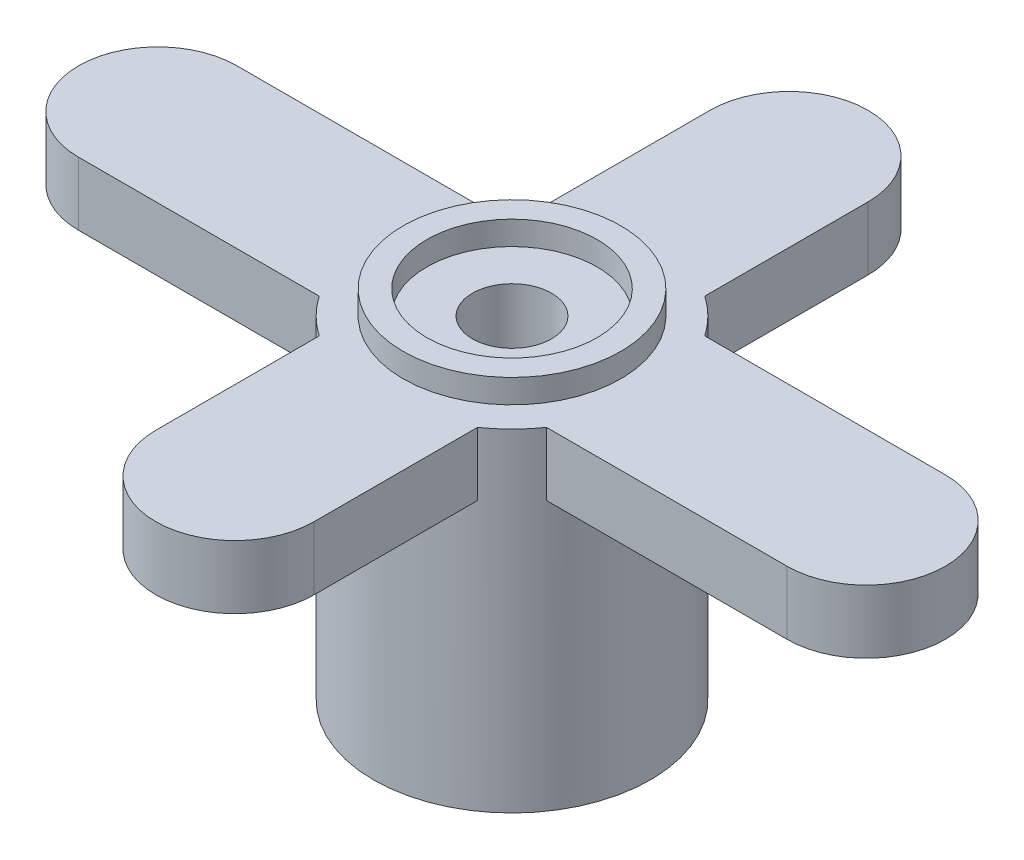
ISO-10303-21;
HEADER;
FILE_DESCRIPTION(('STEP AP214'),'2;1');
FILE_NAME('part.step','',(''),(''),'','','');
FILE_SCHEMA(('AUTOMOTIVE_DESIGN { 1 0 10303 214 1 1 1 1 }'));
ENDSEC;
DATA;
#1=APPLICATION_CONTEXT('core data for automotive mechanical design processes');
#2=APPLICATION_PROTOCOL_DEFINITION('international standard','automotive_design',2000,#1);
#3=PRODUCT_CONTEXT('',#1,'mechanical');
#4=PRODUCT('Part','Part','',(#3));
#5=PRODUCT_RELATED_PRODUCT_CATEGORY('part','',(#4));
#6=PRODUCT_DEFINITION_FORMATION('','',#4);
#7=PRODUCT_DEFINITION_CONTEXT('part definition',#1,'design');
#8=PRODUCT_DEFINITION('design','',#6,#7);
#9=PRODUCT_DEFINITION_SHAPE('','',#8);
#10=(LENGTH_UNIT() NAMED_UNIT(*) SI_UNIT(.MILLI.,.METRE.));
#11=(NAMED_UNIT(*) PLANE_ANGLE_UNIT() SI_UNIT($,.RADIAN.));
#12=(NAMED_UNIT(*) SI_UNIT($,.STERADIAN.) SOLID_ANGLE_UNIT());
#13=UNCERTAINTY_MEASURE_WITH_UNIT(LENGTH_MEASURE(1.E-05),#10,'distance_accuracy_value','');
#14=(GEOMETRIC_REPRESENTATION_CONTEXT(3) GLOBAL_UNCERTAINTY_ASSIGNED_CONTEXT((#13)) GLOBAL_UNIT_ASSIGNED_CONTEXT((#10,
#11,#12)) REPRESENTATION_CONTEXT('',''));
#15=CARTESIAN_POINT('',(0.,0.,0.));
#16=DIRECTION('',(0.,0.,1.));
#17=DIRECTION('',(1.,0.,0.));
#18=AXIS2_PLACEMENT_3D('',#15,#16,#17);
#19=CARTESIAN_POINT('',(0.,9.,0.));
#20=DIRECTION('',(0.,-1.,0.));
#21=DIRECTION('',(0.,0.,-1.));
#22=AXIS2_PLACEMENT_3D('',#19,#20,#21);
#23=CYLINDRICAL_SURFACE('',#22,3.5);
#24=CARTESIAN_POINT('',(0.,0.,0.));
#25=DIRECTION('',(0.,1.,0.));
#26=DIRECTION('',(0.,0.,1.));
#27=AXIS2_PLACEMENT_3D('',#24,#25,#26);
#28=CIRCLE('',#27,3.5);
#29=CARTESIAN_POINT('',(0.,0.,3.5));
#30=VERTEX_POINT('',#29);
#31=EDGE_CURVE('E178',#30,#30,#28,.T.);
#32=ORIENTED_EDGE('',*,*,#31,.T.);
#33=EDGE_LOOP('',(#32));
#34=FACE_BOUND('',#33,.T.);
#35=CARTESIAN_POINT('',(0.,8.4,0.));
#36=DIRECTION('',(0.,1.,0.));
#37=DIRECTION('',(0.,0.,1.));
#38=AXIS2_PLACEMENT_3D('',#35,#36,#37);
#39=CIRCLE('',#38,3.5);
#40=CARTESIAN_POINT('',(2.87228132326901,8.4,2.));
#41=VERTEX_POINT('',#40);
#42=CARTESIAN_POINT('',(2.,8.4,2.87228132326901));
#43=VERTEX_POINT('',#42);
#44=EDGE_CURVE('E164',#41,#43,#39,.F.);
#45=ORIENTED_EDGE('',*,*,#44,.T.);
#46=DIRECTION('',(0.,-1.,0.));
#47=VECTOR('',#46,1.);
#48=CARTESIAN_POINT('',(2.,9.,2.87228132326901));
#49=LINE('',#48,#47);
#50=CARTESIAN_POINT('',(2.,6.8,2.87228132326901));
#51=VERTEX_POINT('',#50);
#52=EDGE_CURVE('E203',#43,#51,#49,.T.);
#53=ORIENTED_EDGE('',*,*,#52,.T.);
#54=CARTESIAN_POINT('',(0.,6.8,0.));
#55=DIRECTION('',(0.,1.,0.));
#56=DIRECTION('',(0.,0.,1.));
#57=AXIS2_PLACEMENT_3D('',#54,#55,#56);
#58=CIRCLE('',#57,3.5);
#59=CARTESIAN_POINT('',(-2.,6.8,2.87228132326901));
#60=VERTEX_POINT('',#59);
#61=EDGE_CURVE('E11',#60,#51,#58,.T.);
#62=ORIENTED_EDGE('',*,*,#61,.F.);
#63=DIRECTION('',(0.,-1.,0.));
#64=VECTOR('',#63,1.);
#65=CARTESIAN_POINT('',(-2.,9.,2.87228132326901));
#66=LINE('',#65,#64);
#67=CARTESIAN_POINT('',(-2.,8.4,2.87228132326901));
#68=VERTEX_POINT('',#67);
#69=EDGE_CURVE('E46',#68,#60,#66,.T.);
#70=ORIENTED_EDGE('',*,*,#69,.F.);
#71=CARTESIAN_POINT('',(-2.87228132326901,8.4,2.));
#72=VERTEX_POINT('',#71);
#73=EDGE_CURVE('E153',#68,#72,#39,.F.);
#74=ORIENTED_EDGE('',*,*,#73,.T.);
#75=DIRECTION('',(0.,-1.,0.));
#76=VECTOR('',#75,1.);
#77=CARTESIAN_POINT('',(-2.87228132326901,9.,2.));
#78=LINE('',#77,#76);
#79=CARTESIAN_POINT('',(-2.87228132326901,6.8,2.));
#80=VERTEX_POINT('',#79);
#81=EDGE_CURVE('E156',#72,#80,#78,.T.);
#82=ORIENTED_EDGE('',*,*,#81,.T.);
#83=CARTESIAN_POINT('',(0.,6.8,0.));
#84=DIRECTION('',(0.,1.,0.));
#85=DIRECTION('',(0.,0.,1.));
#86=AXIS2_PLACEMENT_3D('',#83,#84,#85);
#87=CIRCLE('',#86,3.5);
#88=CARTESIAN_POINT('',(-2.87228132326901,6.8,-2.));
#89=VERTEX_POINT('',#88);
#90=EDGE_CURVE('E53',#89,#80,#87,.T.);
#91=ORIENTED_EDGE('',*,*,#90,.F.);
#92=DIRECTION('',(0.,-1.,0.));
#93=VECTOR('',#92,1.);
#94=CARTESIAN_POINT('',(-2.87228132326901,9.,-2.));
#95=LINE('',#94,#93);
#96=CARTESIAN_POINT('',(-2.87228132326901,8.4,-2.));
#97=VERTEX_POINT('',#96);
#98=EDGE_CURVE('E61',#97,#89,#95,.T.);
#99=ORIENTED_EDGE('',*,*,#98,.F.);
#100=CARTESIAN_POINT('',(-2.,8.4,-2.87228132326901));
#101=VERTEX_POINT('',#100);
#102=EDGE_CURVE('E162',#97,#101,#39,.F.);
#103=ORIENTED_EDGE('',*,*,#102,.T.);
#104=DIRECTION('',(0.,-1.,0.));
#105=VECTOR('',#104,1.);
#106=CARTESIAN_POINT('',(-2.,9.,-2.87228132326901));
#107=LINE('',#106,#105);
#108=CARTESIAN_POINT('',(-2.,6.8,-2.87228132326901));
#109=VERTEX_POINT('',#108);
#110=EDGE_CURVE('E187',#109,#101,#107,.F.);
#111=ORIENTED_EDGE('',*,*,#110,.F.);
#112=CARTESIAN_POINT('',(0.,6.8,0.));
#113=DIRECTION('',(0.,1.,0.));
#114=DIRECTION('',(0.,0.,1.));
#115=AXIS2_PLACEMENT_3D('',#112,#113,#114);
#116=CIRCLE('',#115,3.5);
#117=CARTESIAN_POINT('',(2.,6.8,-2.87228132326901));
#118=VERTEX_POINT('',#117);
#119=EDGE_CURVE('E193',#118,#109,#116,.T.);
#120=ORIENTED_EDGE('',*,*,#119,.F.);
#121=DIRECTION('',(0.,-1.,0.));
#122=VECTOR('',#121,1.);
#123=CARTESIAN_POINT('',(2.,9.,-2.87228132326901));
#124=LINE('',#123,#122);
#125=CARTESIAN_POINT('',(2.,8.4,-2.87228132326901));
#126=VERTEX_POINT('',#125);
#127=EDGE_CURVE('E190',#118,#126,#124,.F.);
#128=ORIENTED_EDGE('',*,*,#127,.T.);
#129=CARTESIAN_POINT('',(2.87228132326901,8.4,-2.));
#130=VERTEX_POINT('',#129);
#131=EDGE_CURVE('E402',#126,#130,#39,.F.);
#132=ORIENTED_EDGE('',*,*,#131,.T.);
#133=DIRECTION('',(0.,-1.,0.));
#134=VECTOR('',#133,1.);
#135=CARTESIAN_POINT('',(2.87228132326901,9.,-2.));
#136=LINE('',#135,#134);
#137=CARTESIAN_POINT('',(2.87228132326901,6.8,-2.));
#138=VERTEX_POINT('',#137);
#139=EDGE_CURVE('E195',#138,#130,#136,.F.);
#140=ORIENTED_EDGE('',*,*,#139,.F.);
#141=CARTESIAN_POINT('',(0.,6.8,0.));
#142=DIRECTION('',(0.,1.,0.));
#143=DIRECTION('',(0.,0.,1.));
#144=AXIS2_PLACEMENT_3D('',#141,#142,#143);
#145=CIRCLE('',#144,3.5);
#146=CARTESIAN_POINT('',(2.87228132326901,6.8,2.));
#147=VERTEX_POINT('',#146);
#148=EDGE_CURVE('E201',#147,#138,#145,.T.);
#149=ORIENTED_EDGE('',*,*,#148,.F.);
#150=DIRECTION('',(0.,-1.,0.));
#151=VECTOR('',#150,1.);
#152=CARTESIAN_POINT('',(2.87228132326901,9.,2.));
#153=LINE('',#152,#151);
#154=EDGE_CURVE('E198',#147,#41,#153,.F.);
#155=ORIENTED_EDGE('',*,*,#154,.T.);
#156=EDGE_LOOP('',(#45,#53,#62,#70,#74,#82,#91,#99,#103,#111,#120,#128,#132,#140,#149,#155));
#157=FACE_BOUND('',#156,.T.);
#158=ADVANCED_FACE('F39',(#34,#157),#23,.T.);
#159=CARTESIAN_POINT('',(0.,9.,0.));
#160=DIRECTION('',(0.,1.,0.));
#161=DIRECTION('',(0.,0.,1.));
#162=AXIS2_PLACEMENT_3D('',#159,#160,#161);
#163=PLANE('',#162);
#164=CARTESIAN_POINT('',(0.,9.,0.));
#165=DIRECTION('',(0.,1.,0.));
#166=DIRECTION('',(0.,0.,1.));
#167=AXIS2_PLACEMENT_3D('',#164,#165,#166);
#168=CIRCLE('',#167,2.15);
#169=CARTESIAN_POINT('',(0.,9.,2.15));
#170=VERTEX_POINT('',#169);
#171=EDGE_CURVE('E411',#170,#170,#168,.T.);
#172=ORIENTED_EDGE('',*,*,#171,.F.);
#173=EDGE_LOOP('',(#172));
#174=FACE_BOUND('',#173,.T.);
#175=CARTESIAN_POINT('',(0.,9.,0.));
#176=DIRECTION('',(0.,1.,0.));
#177=DIRECTION('',(0.,0.,1.));
#178=AXIS2_PLACEMENT_3D('',#175,#176,#177);
#179=CIRCLE('',#178,2.75);
#180=CARTESIAN_POINT('',(0.,9.,2.75));
#181=VERTEX_POINT('',#180);
#182=EDGE_CURVE('E400',#181,#181,#179,.T.);
#183=ORIENTED_EDGE('',*,*,#182,.T.);
#184=EDGE_LOOP('',(#183));
#185=FACE_BOUND('',#184,.T.);
#186=ADVANCED_FACE('F301',(#174,#185),#163,.T.);
#187=CARTESIAN_POINT('',(0.,0.,0.));
#188=DIRECTION('',(0.,1.,0.));
#189=DIRECTION('',(0.,0.,1.));
#190=AXIS2_PLACEMENT_3D('',#187,#188,#189);
#191=PLANE('',#190);
#192=CARTESIAN_POINT('',(0.,0.,0.));
#193=DIRECTION('',(0.,-1.,0.));
#194=DIRECTION('',(0.,0.,-1.));
#195=AXIS2_PLACEMENT_3D('',#192,#193,#194);
#196=CIRCLE('',#195,1.9);
#197=CARTESIAN_POINT('',(0.,0.,-1.9));
#198=VERTEX_POINT('',#197);
#199=EDGE_CURVE('E290',#198,#198,#196,.T.);
#200=ORIENTED_EDGE('',*,*,#199,.F.);
#201=EDGE_LOOP('',(#200));
#202=FACE_BOUND('',#201,.T.);
#203=ORIENTED_EDGE('',*,*,#31,.F.);
#204=EDGE_LOOP('',(#203));
#205=FACE_BOUND('',#204,.T.);
#206=ADVANCED_FACE('F298',(#202,#205),#191,.F.);
#207=CARTESIAN_POINT('',(0.,3.5,0.));
#208=DIRECTION('',(0.,-1.,0.));
#209=DIRECTION('',(0.,0.,-1.));
#210=AXIS2_PLACEMENT_3D('',#207,#208,#209);
#211=CYLINDRICAL_SURFACE('',#210,1.9);
#212=CARTESIAN_POINT('',(0.,3.5,0.));
#213=DIRECTION('',(0.,-1.,0.));
#214=DIRECTION('',(0.,0.,-1.));
#215=AXIS2_PLACEMENT_3D('',#212,#213,#214);
#216=CIRCLE('',#215,1.9);
#217=CARTESIAN_POINT('',(0.,3.5,-1.9));
#218=VERTEX_POINT('',#217);
#219=EDGE_CURVE('E182',#218,#218,#216,.T.);
#220=ORIENTED_EDGE('',*,*,#219,.F.);
#221=EDGE_LOOP('',(#220));
#222=FACE_BOUND('',#221,.T.);
#223=ORIENTED_EDGE('',*,*,#199,.T.);
#224=EDGE_LOOP('',(#223));
#225=FACE_BOUND('',#224,.T.);
#226=ADVANCED_FACE('F296',(#222,#225),#211,.F.);
#227=CARTESIAN_POINT('',(0.,3.5,0.));
#228=DIRECTION('',(0.,-1.,0.));
#229=DIRECTION('',(0.,0.,-1.));
#230=AXIS2_PLACEMENT_3D('',#227,#228,#229);
#231=PLANE('',#230);
#232=CARTESIAN_POINT('',(0.,3.5,0.));
#233=DIRECTION('',(0.,-1.,0.));
#234=DIRECTION('',(0.,0.,-1.));
#235=AXIS2_PLACEMENT_3D('',#232,#233,#234);
#236=CIRCLE('',#235,1.);
#237=CARTESIAN_POINT('',(0.,3.5,-1.));
#238=VERTEX_POINT('',#237);
#239=EDGE_CURVE('E408',#238,#238,#236,.T.);
#240=ORIENTED_EDGE('',*,*,#239,.F.);
#241=EDGE_LOOP('',(#240));
#242=FACE_BOUND('',#241,.T.);
#243=ORIENTED_EDGE('',*,*,#219,.T.);
#244=EDGE_LOOP('',(#243));
#245=FACE_BOUND('',#244,.T.);
#246=ADVANCED_FACE('F317',(#242,#245),#231,.T.);
#247=CARTESIAN_POINT('',(0.,6.8,-2.));
#248=DIRECTION('',(0.,0.,1.));
#249=DIRECTION('',(1.,0.,0.));
#250=AXIS2_PLACEMENT_3D('',#247,#248,#249);
#251=PLANE('',#250);
#252=DIRECTION('',(1.,0.,0.));
#253=VECTOR('',#252,1.);
#254=CARTESIAN_POINT('',(0.,8.4,-2.));
#255=LINE('',#254,#253);
#256=CARTESIAN_POINT('',(-8.95,8.4,-2.));
#257=VERTEX_POINT('',#256);
#258=EDGE_CURVE('E174',#257,#97,#255,.T.);
#259=ORIENTED_EDGE('',*,*,#258,.T.);
#260=ORIENTED_EDGE('',*,*,#98,.T.);
#261=DIRECTION('',(1.,0.,0.));
#262=VECTOR('',#261,1.);
#263=CARTESIAN_POINT('',(0.,6.8,-2.));
#264=LINE('',#263,#262);
#265=CARTESIAN_POINT('',(-8.95,6.8,-2.));
#266=VERTEX_POINT('',#265);
#267=EDGE_CURVE('E283',#266,#89,#264,.T.);
#268=ORIENTED_EDGE('',*,*,#267,.F.);
#269=DIRECTION('',(0.,1.,0.));
#270=VECTOR('',#269,1.);
#271=CARTESIAN_POINT('',(-8.95,6.8,-2.));
#272=LINE('',#271,#270);
#273=EDGE_CURVE('E288',#266,#257,#272,.T.);
#274=ORIENTED_EDGE('',*,*,#273,.T.);
#275=EDGE_LOOP('',(#259,#260,#268,#274));
#276=FACE_BOUND('',#275,.T.);
#277=ADVANCED_FACE('F321',(#276),#251,.F.);
#278=CARTESIAN_POINT('',(0.,6.8,2.));
#279=DIRECTION('',(0.,0.,1.));
#280=DIRECTION('',(1.,0.,0.));
#281=AXIS2_PLACEMENT_3D('',#278,#279,#280);
#282=PLANE('',#281);
#283=ORIENTED_EDGE('',*,*,#81,.F.);
#284=DIRECTION('',(1.,0.,0.));
#285=VECTOR('',#284,1.);
#286=CARTESIAN_POINT('',(0.,8.4,2.));
#287=LINE('',#286,#285);
#288=CARTESIAN_POINT('',(-8.95,8.4,2.));
#289=VERTEX_POINT('',#288);
#290=EDGE_CURVE('E167',#289,#72,#287,.T.);
#291=ORIENTED_EDGE('',*,*,#290,.F.);
#292=DIRECTION('',(0.,1.,0.));
#293=VECTOR('',#292,1.);
#294=CARTESIAN_POINT('',(-8.95,6.8,2.));
#295=LINE('',#294,#293);
#296=CARTESIAN_POINT('',(-8.95,6.8,2.));
#297=VERTEX_POINT('',#296);
#298=EDGE_CURVE('E285',#297,#289,#295,.T.);
#299=ORIENTED_EDGE('',*,*,#298,.F.);
#300=DIRECTION('',(1.,0.,0.));
#301=VECTOR('',#300,1.);
#302=CARTESIAN_POINT('',(0.,6.8,2.));
#303=LINE('',#302,#301);
#304=EDGE_CURVE('E177',#297,#80,#303,.T.);
#305=ORIENTED_EDGE('',*,*,#304,.T.);
#306=EDGE_LOOP('',(#283,#291,#299,#305));
#307=FACE_BOUND('',#306,.T.);
#308=ADVANCED_FACE('F176',(#307),#282,.T.);
#309=CARTESIAN_POINT('',(-8.95,6.8,0.));
#310=DIRECTION('',(0.,1.,0.));
#311=DIRECTION('',(0.,0.,1.));
#312=AXIS2_PLACEMENT_3D('',#309,#310,#311);
#313=CYLINDRICAL_SURFACE('',#312,2.);
#314=CARTESIAN_POINT('',(-8.95,8.4,0.));
#315=DIRECTION('',(0.,1.,0.));
#316=DIRECTION('',(0.,0.,1.));
#317=AXIS2_PLACEMENT_3D('',#314,#315,#316);
#318=CIRCLE('',#317,2.);
#319=EDGE_CURVE('E172',#257,#289,#318,.T.);
#320=ORIENTED_EDGE('',*,*,#319,.F.);
#321=ORIENTED_EDGE('',*,*,#273,.F.);
#322=CARTESIAN_POINT('',(-8.95,6.8,0.));
#323=DIRECTION('',(0.,1.,0.));
#324=DIRECTION('',(0.,0.,1.));
#325=AXIS2_PLACEMENT_3D('',#322,#323,#324);
#326=CIRCLE('',#325,2.);
#327=EDGE_CURVE('E279',#266,#297,#326,.T.);
#328=ORIENTED_EDGE('',*,*,#327,.T.);
#329=ORIENTED_EDGE('',*,*,#298,.T.);
#330=EDGE_LOOP('',(#320,#321,#328,#329));
#331=FACE_BOUND('',#330,.T.);
#332=ADVANCED_FACE('F323',(#331),#313,.T.);
#333=CARTESIAN_POINT('',(0.,6.8,0.));
#334=DIRECTION('',(0.,1.,0.));
#335=DIRECTION('',(0.,0.,1.));
#336=AXIS2_PLACEMENT_3D('',#333,#334,#335);
#337=PLANE('',#336);
#338=ORIENTED_EDGE('',*,*,#267,.T.);
#339=ORIENTED_EDGE('',*,*,#90,.T.);
#340=ORIENTED_EDGE('',*,*,#304,.F.);
#341=ORIENTED_EDGE('',*,*,#327,.F.);
#342=EDGE_LOOP('',(#338,#339,#340,#341));
#343=FACE_BOUND('',#342,.T.);
#344=ADVANCED_FACE('F326',(#343),#337,.F.);
#345=CARTESIAN_POINT('',(0.,8.4,0.));
#346=DIRECTION('',(0.,1.,0.));
#347=DIRECTION('',(0.,0.,1.));
#348=AXIS2_PLACEMENT_3D('',#345,#346,#347);
#349=PLANE('',#348);
#350=ORIENTED_EDGE('',*,*,#290,.T.);
#351=ORIENTED_EDGE('',*,*,#73,.F.);
#352=DIRECTION('',(0.,0.,-1.));
#353=VECTOR('',#352,1.);
#354=CARTESIAN_POINT('',(-2.,8.4,0.));
#355=LINE('',#354,#353);
#356=CARTESIAN_POINT('',(-2.,8.4,7.));
#357=VERTEX_POINT('',#356);
#358=EDGE_CURVE('E211',#357,#68,#355,.T.);
#359=ORIENTED_EDGE('',*,*,#358,.F.);
#360=CARTESIAN_POINT('',(0.,8.4,7.));
#361=DIRECTION('',(0.,1.,0.));
#362=DIRECTION('',(0.,0.,1.));
#363=AXIS2_PLACEMENT_3D('',#360,#361,#362);
#364=CIRCLE('',#363,2.);
#365=CARTESIAN_POINT('',(2.,8.4,7.));
#366=VERTEX_POINT('',#365);
#367=EDGE_CURVE('E218',#357,#366,#364,.T.);
#368=ORIENTED_EDGE('',*,*,#367,.T.);
#369=DIRECTION('',(0.,0.,-1.));
#370=VECTOR('',#369,1.);
#371=CARTESIAN_POINT('',(2.,8.4,0.));
#372=LINE('',#371,#370);
#373=EDGE_CURVE('E226',#366,#43,#372,.T.);
#374=ORIENTED_EDGE('',*,*,#373,.T.);
#375=ORIENTED_EDGE('',*,*,#44,.F.);
#376=DIRECTION('',(1.,0.,0.));
#377=VECTOR('',#376,1.);
#378=CARTESIAN_POINT('',(0.,8.4,2.));
#379=LINE('',#378,#377);
#380=CARTESIAN_POINT('',(8.95,8.4,2.));
#381=VERTEX_POINT('',#380);
#382=EDGE_CURVE('E254',#41,#381,#379,.T.);
#383=ORIENTED_EDGE('',*,*,#382,.T.);
#384=CARTESIAN_POINT('',(8.95,8.4,0.));
#385=DIRECTION('',(0.,1.,0.));
#386=DIRECTION('',(0.,0.,1.));
#387=AXIS2_PLACEMENT_3D('',#384,#385,#386);
#388=CIRCLE('',#387,2.);
#389=CARTESIAN_POINT('',(8.95,8.4,-2.));
#390=VERTEX_POINT('',#389);
#391=EDGE_CURVE('E250',#381,#390,#388,.T.);
#392=ORIENTED_EDGE('',*,*,#391,.T.);
#393=DIRECTION('',(1.,0.,0.));
#394=VECTOR('',#393,1.);
#395=CARTESIAN_POINT('',(0.,8.4,-2.));
#396=LINE('',#395,#394);
#397=EDGE_CURVE('E243',#130,#390,#396,.T.);
#398=ORIENTED_EDGE('',*,*,#397,.F.);
#399=ORIENTED_EDGE('',*,*,#131,.F.);
#400=DIRECTION('',(0.,0.,-1.));
#401=VECTOR('',#400,1.);
#402=CARTESIAN_POINT('',(2.,8.4,0.));
#403=LINE('',#402,#401);
#404=CARTESIAN_POINT('',(2.,8.4,-7.));
#405=VERTEX_POINT('',#404);
#406=EDGE_CURVE('E273',#126,#405,#403,.T.);
#407=ORIENTED_EDGE('',*,*,#406,.T.);
#408=CARTESIAN_POINT('',(0.,8.4,-7.));
#409=DIRECTION('',(0.,1.,0.));
#410=DIRECTION('',(0.,0.,1.));
#411=AXIS2_PLACEMENT_3D('',#408,#409,#410);
#412=CIRCLE('',#411,2.);
#413=CARTESIAN_POINT('',(-2.,8.4,-7.));
#414=VERTEX_POINT('',#413);
#415=EDGE_CURVE('E270',#405,#414,#412,.T.);
#416=ORIENTED_EDGE('',*,*,#415,.T.);
#417=DIRECTION('',(0.,0.,-1.));
#418=VECTOR('',#417,1.);
#419=CARTESIAN_POINT('',(-2.,8.4,0.));
#420=LINE('',#419,#418);
#421=EDGE_CURVE('E263',#101,#414,#420,.T.);
#422=ORIENTED_EDGE('',*,*,#421,.F.);
#423=ORIENTED_EDGE('',*,*,#102,.F.);
#424=ORIENTED_EDGE('',*,*,#258,.F.);
#425=ORIENTED_EDGE('',*,*,#319,.T.);
#426=EDGE_LOOP('',(#350,#351,#359,#368,#374,#375,#383,#392,#398,#399,#407,#416,#422,#423,#424,#425));
#427=FACE_BOUND('',#426,.T.);
#428=CARTESIAN_POINT('',(0.,8.4,0.));
#429=DIRECTION('',(0.,1.,0.));
#430=DIRECTION('',(0.,0.,1.));
#431=AXIS2_PLACEMENT_3D('',#428,#429,#430);
#432=CIRCLE('',#431,2.75);
#433=CARTESIAN_POINT('',(0.,8.4,2.75));
#434=VERTEX_POINT('',#433);
#435=EDGE_CURVE('E161',#434,#434,#432,.F.);
#436=ORIENTED_EDGE('',*,*,#435,.T.);
#437=EDGE_LOOP('',(#436));
#438=FACE_BOUND('',#437,.T.);
#439=ADVANCED_FACE('F168',(#427,#438),#349,.T.);
#440=CARTESIAN_POINT('',(2.,6.8,0.));
#441=DIRECTION('',(1.,0.,0.));
#442=DIRECTION('',(0.,0.,-1.));
#443=AXIS2_PLACEMENT_3D('',#440,#441,#442);
#444=PLANE('',#443);
#445=ORIENTED_EDGE('',*,*,#127,.F.);
#446=DIRECTION('',(0.,0.,-1.));
#447=VECTOR('',#446,1.);
#448=CARTESIAN_POINT('',(2.,6.8,0.));
#449=LINE('',#448,#447);
#450=CARTESIAN_POINT('',(2.,6.8,-7.));
#451=VERTEX_POINT('',#450);
#452=EDGE_CURVE('E253',#118,#451,#449,.T.);
#453=ORIENTED_EDGE('',*,*,#452,.T.);
#454=DIRECTION('',(0.,1.,0.));
#455=VECTOR('',#454,1.);
#456=CARTESIAN_POINT('',(2.,6.8,-7.));
#457=LINE('',#456,#455);
#458=EDGE_CURVE('E260',#451,#405,#457,.T.);
#459=ORIENTED_EDGE('',*,*,#458,.T.);
#460=ORIENTED_EDGE('',*,*,#406,.F.);
#461=EDGE_LOOP('',(#445,#453,#459,#460));
#462=FACE_BOUND('',#461,.T.);
#463=ADVANCED_FACE('F334',(#462),#444,.T.);
#464=CARTESIAN_POINT('',(-2.,6.8,0.));
#465=DIRECTION('',(1.,0.,0.));
#466=DIRECTION('',(0.,0.,-1.));
#467=AXIS2_PLACEMENT_3D('',#464,#465,#466);
#468=PLANE('',#467);
#469=DIRECTION('',(0.,0.,-1.));
#470=VECTOR('',#469,1.);
#471=CARTESIAN_POINT('',(-2.,6.8,0.));
#472=LINE('',#471,#470);
#473=CARTESIAN_POINT('',(-2.,6.8,-7.));
#474=VERTEX_POINT('',#473);
#475=EDGE_CURVE('E267',#109,#474,#472,.T.);
#476=ORIENTED_EDGE('',*,*,#475,.F.);
#477=ORIENTED_EDGE('',*,*,#110,.T.);
#478=ORIENTED_EDGE('',*,*,#421,.T.);
#479=DIRECTION('',(0.,1.,0.));
#480=VECTOR('',#479,1.);
#481=CARTESIAN_POINT('',(-2.,6.8,-7.));
#482=LINE('',#481,#480);
#483=EDGE_CURVE('E264',#474,#414,#482,.T.);
#484=ORIENTED_EDGE('',*,*,#483,.F.);
#485=EDGE_LOOP('',(#476,#477,#478,#484));
#486=FACE_BOUND('',#485,.T.);
#487=ADVANCED_FACE('F343',(#486),#468,.F.);
#488=CARTESIAN_POINT('',(0.,6.8,-7.));
#489=DIRECTION('',(0.,1.,0.));
#490=DIRECTION('',(0.,0.,1.));
#491=AXIS2_PLACEMENT_3D('',#488,#489,#490);
#492=CYLINDRICAL_SURFACE('',#491,2.);
#493=ORIENTED_EDGE('',*,*,#415,.F.);
#494=ORIENTED_EDGE('',*,*,#458,.F.);
#495=CARTESIAN_POINT('',(0.,6.8,-7.));
#496=DIRECTION('',(0.,1.,0.));
#497=DIRECTION('',(0.,0.,1.));
#498=AXIS2_PLACEMENT_3D('',#495,#496,#497);
#499=CIRCLE('',#498,2.);
#500=EDGE_CURVE('E268',#451,#474,#499,.T.);
#501=ORIENTED_EDGE('',*,*,#500,.T.);
#502=ORIENTED_EDGE('',*,*,#483,.T.);
#503=EDGE_LOOP('',(#493,#494,#501,#502));
#504=FACE_BOUND('',#503,.T.);
#505=ADVANCED_FACE('F341',(#504),#492,.T.);
#506=CARTESIAN_POINT('',(0.,6.8,0.));
#507=DIRECTION('',(0.,1.,0.));
#508=DIRECTION('',(0.,0.,1.));
#509=AXIS2_PLACEMENT_3D('',#506,#507,#508);
#510=PLANE('',#509);
#511=ORIENTED_EDGE('',*,*,#452,.F.);
#512=ORIENTED_EDGE('',*,*,#119,.T.);
#513=ORIENTED_EDGE('',*,*,#475,.T.);
#514=ORIENTED_EDGE('',*,*,#500,.F.);
#515=EDGE_LOOP('',(#511,#512,#513,#514));
#516=FACE_BOUND('',#515,.T.);
#517=ADVANCED_FACE('F337',(#516),#510,.F.);
#518=CARTESIAN_POINT('',(0.,6.8,2.));
#519=DIRECTION('',(0.,0.,1.));
#520=DIRECTION('',(1.,0.,0.));
#521=AXIS2_PLACEMENT_3D('',#518,#519,#520);
#522=PLANE('',#521);
#523=ORIENTED_EDGE('',*,*,#154,.F.);
#524=DIRECTION('',(1.,0.,0.));
#525=VECTOR('',#524,1.);
#526=CARTESIAN_POINT('',(0.,6.8,2.));
#527=LINE('',#526,#525);
#528=CARTESIAN_POINT('',(8.95,6.8,2.));
#529=VERTEX_POINT('',#528);
#530=EDGE_CURVE('E237',#147,#529,#527,.T.);
#531=ORIENTED_EDGE('',*,*,#530,.T.);
#532=DIRECTION('',(0.,1.,0.));
#533=VECTOR('',#532,1.);
#534=CARTESIAN_POINT('',(8.95,6.8,2.));
#535=LINE('',#534,#533);
#536=EDGE_CURVE('E240',#529,#381,#535,.T.);
#537=ORIENTED_EDGE('',*,*,#536,.T.);
#538=ORIENTED_EDGE('',*,*,#382,.F.);
#539=EDGE_LOOP('',(#523,#531,#537,#538));
#540=FACE_BOUND('',#539,.T.);
#541=ADVANCED_FACE('F340',(#540),#522,.T.);
#542=CARTESIAN_POINT('',(0.,6.8,-2.));
#543=DIRECTION('',(0.,0.,1.));
#544=DIRECTION('',(1.,0.,0.));
#545=AXIS2_PLACEMENT_3D('',#542,#543,#544);
#546=PLANE('',#545);
#547=DIRECTION('',(1.,0.,0.));
#548=VECTOR('',#547,1.);
#549=CARTESIAN_POINT('',(0.,6.8,-2.));
#550=LINE('',#549,#548);
#551=CARTESIAN_POINT('',(8.95,6.8,-2.));
#552=VERTEX_POINT('',#551);
#553=EDGE_CURVE('E247',#138,#552,#550,.T.);
#554=ORIENTED_EDGE('',*,*,#553,.F.);
#555=ORIENTED_EDGE('',*,*,#139,.T.);
#556=ORIENTED_EDGE('',*,*,#397,.T.);
#557=DIRECTION('',(0.,1.,0.));
#558=VECTOR('',#557,1.);
#559=CARTESIAN_POINT('',(8.95,6.8,-2.));
#560=LINE('',#559,#558);
#561=EDGE_CURVE('E244',#552,#390,#560,.T.);
#562=ORIENTED_EDGE('',*,*,#561,.F.);
#563=EDGE_LOOP('',(#554,#555,#556,#562));
#564=FACE_BOUND('',#563,.T.);
#565=ADVANCED_FACE('F358',(#564),#546,.F.);
#566=CARTESIAN_POINT('',(8.95,6.8,0.));
#567=DIRECTION('',(0.,1.,0.));
#568=DIRECTION('',(0.,0.,1.));
#569=AXIS2_PLACEMENT_3D('',#566,#567,#568);
#570=CYLINDRICAL_SURFACE('',#569,2.);
#571=ORIENTED_EDGE('',*,*,#391,.F.);
#572=ORIENTED_EDGE('',*,*,#536,.F.);
#573=CARTESIAN_POINT('',(8.95,6.8,0.));
#574=DIRECTION('',(0.,1.,0.));
#575=DIRECTION('',(0.,0.,1.));
#576=AXIS2_PLACEMENT_3D('',#573,#574,#575);
#577=CIRCLE('',#576,2.);
#578=EDGE_CURVE('E248',#529,#552,#577,.T.);
#579=ORIENTED_EDGE('',*,*,#578,.T.);
#580=ORIENTED_EDGE('',*,*,#561,.T.);
#581=EDGE_LOOP('',(#571,#572,#579,#580));
#582=FACE_BOUND('',#581,.T.);
#583=ADVANCED_FACE('F356',(#582),#570,.T.);
#584=CARTESIAN_POINT('',(0.,6.8,0.));
#585=DIRECTION('',(0.,1.,0.));
#586=DIRECTION('',(0.,0.,1.));
#587=AXIS2_PLACEMENT_3D('',#584,#585,#586);
#588=PLANE('',#587);
#589=ORIENTED_EDGE('',*,*,#530,.F.);
#590=ORIENTED_EDGE('',*,*,#148,.T.);
#591=ORIENTED_EDGE('',*,*,#553,.T.);
#592=ORIENTED_EDGE('',*,*,#578,.F.);
#593=EDGE_LOOP('',(#589,#590,#591,#592));
#594=FACE_BOUND('',#593,.T.);
#595=ADVANCED_FACE('F353',(#594),#588,.F.);
#596=CARTESIAN_POINT('',(-2.,6.8,0.));
#597=DIRECTION('',(1.,0.,0.));
#598=DIRECTION('',(0.,0.,-1.));
#599=AXIS2_PLACEMENT_3D('',#596,#597,#598);
#600=PLANE('',#599);
#601=ORIENTED_EDGE('',*,*,#358,.T.);
#602=ORIENTED_EDGE('',*,*,#69,.T.);
#603=DIRECTION('',(0.,0.,-1.));
#604=VECTOR('',#603,1.);
#605=CARTESIAN_POINT('',(-2.,6.8,0.));
#606=LINE('',#605,#604);
#607=CARTESIAN_POINT('',(-2.,6.8,7.));
#608=VERTEX_POINT('',#607);
#609=EDGE_CURVE('E209',#608,#60,#606,.T.);
#610=ORIENTED_EDGE('',*,*,#609,.F.);
#611=DIRECTION('',(0.,1.,0.));
#612=VECTOR('',#611,1.);
#613=CARTESIAN_POINT('',(-2.,6.8,7.));
#614=LINE('',#613,#612);
#615=EDGE_CURVE('E229',#608,#357,#614,.T.);
#616=ORIENTED_EDGE('',*,*,#615,.T.);
#617=EDGE_LOOP('',(#601,#602,#610,#616));
#618=FACE_BOUND('',#617,.T.);
#619=ADVANCED_FACE('F208',(#618),#600,.F.);
#620=CARTESIAN_POINT('',(2.,6.8,0.));
#621=DIRECTION('',(1.,0.,0.));
#622=DIRECTION('',(0.,0.,-1.));
#623=AXIS2_PLACEMENT_3D('',#620,#621,#622);
#624=PLANE('',#623);
#625=ORIENTED_EDGE('',*,*,#52,.F.);
#626=ORIENTED_EDGE('',*,*,#373,.F.);
#627=DIRECTION('',(0.,1.,0.));
#628=VECTOR('',#627,1.);
#629=CARTESIAN_POINT('',(2.,6.8,7.));
#630=LINE('',#629,#628);
#631=CARTESIAN_POINT('',(2.,6.8,7.));
#632=VERTEX_POINT('',#631);
#633=EDGE_CURVE('E228',#632,#366,#630,.T.);
#634=ORIENTED_EDGE('',*,*,#633,.F.);
#635=DIRECTION('',(0.,0.,-1.));
#636=VECTOR('',#635,1.);
#637=CARTESIAN_POINT('',(2.,6.8,0.));
#638=LINE('',#637,#636);
#639=EDGE_CURVE('E219',#632,#51,#638,.T.);
#640=ORIENTED_EDGE('',*,*,#639,.T.);
#641=EDGE_LOOP('',(#625,#626,#634,#640));
#642=FACE_BOUND('',#641,.T.);
#643=ADVANCED_FACE('F225',(#642),#624,.T.);
#644=CARTESIAN_POINT('',(0.,6.8,7.));
#645=DIRECTION('',(0.,1.,0.));
#646=DIRECTION('',(0.,0.,1.));
#647=AXIS2_PLACEMENT_3D('',#644,#645,#646);
#648=CYLINDRICAL_SURFACE('',#647,2.);
#649=ORIENTED_EDGE('',*,*,#367,.F.);
#650=ORIENTED_EDGE('',*,*,#615,.F.);
#651=CARTESIAN_POINT('',(0.,6.8,7.));
#652=DIRECTION('',(0.,1.,0.));
#653=DIRECTION('',(0.,0.,1.));
#654=AXIS2_PLACEMENT_3D('',#651,#652,#653);
#655=CIRCLE('',#654,2.);
#656=EDGE_CURVE('E217',#608,#632,#655,.T.);
#657=ORIENTED_EDGE('',*,*,#656,.T.);
#658=ORIENTED_EDGE('',*,*,#633,.T.);
#659=EDGE_LOOP('',(#649,#650,#657,#658));
#660=FACE_BOUND('',#659,.T.);
#661=ADVANCED_FACE('F368',(#660),#648,.T.);
#662=CARTESIAN_POINT('',(0.,6.8,0.));
#663=DIRECTION('',(0.,1.,0.));
#664=DIRECTION('',(0.,0.,1.));
#665=AXIS2_PLACEMENT_3D('',#662,#663,#664);
#666=PLANE('',#665);
#667=ORIENTED_EDGE('',*,*,#609,.T.);
#668=ORIENTED_EDGE('',*,*,#61,.T.);
#669=ORIENTED_EDGE('',*,*,#639,.F.);
#670=ORIENTED_EDGE('',*,*,#656,.F.);
#671=EDGE_LOOP('',(#667,#668,#669,#670));
#672=FACE_BOUND('',#671,.T.);
#673=ADVANCED_FACE('F213',(#672),#666,.F.);
#674=CARTESIAN_POINT('',(0.,2.31888168179569,0.));
#675=DIRECTION('',(0.,1.,0.));
#676=DIRECTION('',(0.,0.,1.));
#677=AXIS2_PLACEMENT_3D('',#674,#675,#676);
#678=CYLINDRICAL_SURFACE('',#677,2.15);
#679=CARTESIAN_POINT('',(0.,8.4,0.));
#680=DIRECTION('',(0.,1.,0.));
#681=DIRECTION('',(0.,0.,1.));
#682=AXIS2_PLACEMENT_3D('',#679,#680,#681);
#683=CIRCLE('',#682,2.15);
#684=CARTESIAN_POINT('',(0.,8.4,2.15));
#685=VERTEX_POINT('',#684);
#686=EDGE_CURVE('E413',#685,#685,#683,.F.);
#687=ORIENTED_EDGE('',*,*,#686,.T.);
#688=EDGE_LOOP('',(#687));
#689=FACE_BOUND('',#688,.T.);
#690=ORIENTED_EDGE('',*,*,#171,.T.);
#691=EDGE_LOOP('',(#690));
#692=FACE_BOUND('',#691,.T.);
#693=ADVANCED_FACE('F378',(#689,#692),#678,.F.);
#694=CARTESIAN_POINT('',(0.,8.4,0.));
#695=DIRECTION('',(0.,1.,0.));
#696=DIRECTION('',(0.,0.,1.));
#697=AXIS2_PLACEMENT_3D('',#694,#695,#696);
#698=PLANE('',#697);
#699=CARTESIAN_POINT('',(0.,8.4,0.));
#700=DIRECTION('',(0.,1.,0.));
#701=DIRECTION('',(0.,0.,1.));
#702=AXIS2_PLACEMENT_3D('',#699,#700,#701);
#703=CIRCLE('',#702,1.);
#704=CARTESIAN_POINT('',(0.,8.4,1.));
#705=VERTEX_POINT('',#704);
#706=EDGE_CURVE('E405',#705,#705,#703,.T.);
#707=ORIENTED_EDGE('',*,*,#706,.F.);
#708=EDGE_LOOP('',(#707));
#709=FACE_BOUND('',#708,.T.);
#710=ORIENTED_EDGE('',*,*,#686,.F.);
#711=EDGE_LOOP('',(#710));
#712=FACE_BOUND('',#711,.T.);
#713=ADVANCED_FACE('F381',(#709,#712),#698,.T.);
#714=CARTESIAN_POINT('',(0.,-23.2,0.));
#715=DIRECTION('',(0.,1.,0.));
#716=DIRECTION('',(0.,0.,1.));
#717=AXIS2_PLACEMENT_3D('',#714,#715,#716);
#718=CYLINDRICAL_SURFACE('',#717,1.);
#719=ORIENTED_EDGE('',*,*,#239,.T.);
#720=EDGE_LOOP('',(#719));
#721=FACE_BOUND('',#720,.T.);
#722=ORIENTED_EDGE('',*,*,#706,.T.);
#723=EDGE_LOOP('',(#722));
#724=FACE_BOUND('',#723,.T.);
#725=ADVANCED_FACE('F385',(#721,#724),#718,.F.);
#726=CARTESIAN_POINT('',(0.,-1.49949493661167,0.));
#727=DIRECTION('',(0.,1.,0.));
#728=DIRECTION('',(0.,0.,1.));
#729=AXIS2_PLACEMENT_3D('',#726,#727,#728);
#730=CYLINDRICAL_SURFACE('',#729,2.75);
#731=ORIENTED_EDGE('',*,*,#435,.F.);
#732=EDGE_LOOP('',(#731));
#733=FACE_BOUND('',#732,.T.);
#734=ORIENTED_EDGE('',*,*,#182,.F.);
#735=EDGE_LOOP('',(#734));
#736=FACE_BOUND('',#735,.T.);
#737=ADVANCED_FACE('F389',(#733,#736),#730,.T.);
#738=CLOSED_SHELL('',(#158,#186,#206,#226,#246,#277,#308,#332,#344,#439,#463,#487,#505,#517,
#541,#565,#583,#595,#619,#643,#661,#673,#693,#713,#725,#737));
#739=MANIFOLD_SOLID_BREP('B2',#738);
#740=ADVANCED_BREP_SHAPE_REPRESENTATION('',(#18,#739),#14);
#741=SHAPE_DEFINITION_REPRESENTATION(#9,#740);
ENDSEC;
END-ISO-10303-21;
